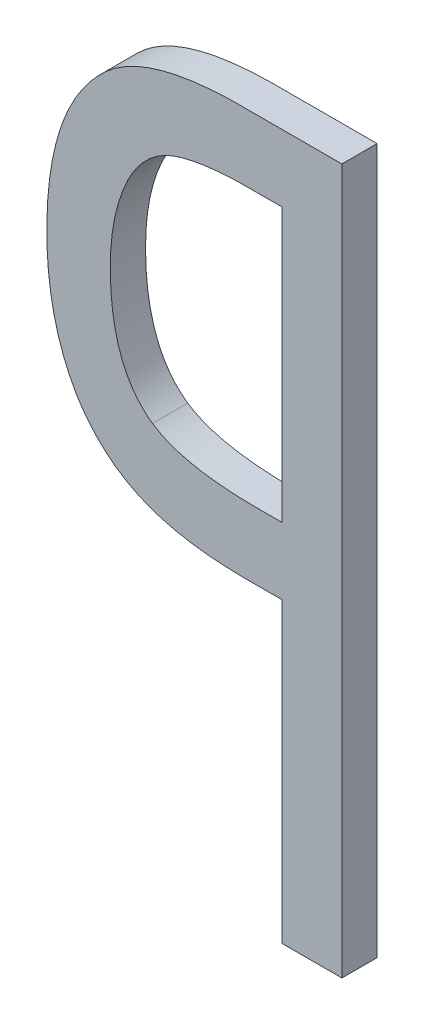
ISO-10303-21;
HEADER;
FILE_DESCRIPTION(('STEP AP214'),'2;1');
FILE_NAME('part.step','',(''),(''),'','','');
FILE_SCHEMA(('AUTOMOTIVE_DESIGN { 1 0 10303 214 1 1 1 1 }'));
ENDSEC;
DATA;
#1=APPLICATION_CONTEXT('core data for automotive mechanical design processes');
#2=APPLICATION_PROTOCOL_DEFINITION('international standard','automotive_design',2000,#1);
#3=PRODUCT_CONTEXT('',#1,'mechanical');
#4=PRODUCT('Part','Part','',(#3));
#5=PRODUCT_RELATED_PRODUCT_CATEGORY('part','',(#4));
#6=PRODUCT_DEFINITION_FORMATION('','',#4);
#7=PRODUCT_DEFINITION_CONTEXT('part definition',#1,'design');
#8=PRODUCT_DEFINITION('design','',#6,#7);
#9=PRODUCT_DEFINITION_SHAPE('','',#8);
#10=(LENGTH_UNIT() NAMED_UNIT(*) SI_UNIT(.MILLI.,.METRE.));
#11=(NAMED_UNIT(*) PLANE_ANGLE_UNIT() SI_UNIT($,.RADIAN.));
#12=(NAMED_UNIT(*) SI_UNIT($,.STERADIAN.) SOLID_ANGLE_UNIT());
#13=UNCERTAINTY_MEASURE_WITH_UNIT(LENGTH_MEASURE(1.E-05),#10,'distance_accuracy_value','');
#14=(GEOMETRIC_REPRESENTATION_CONTEXT(3) GLOBAL_UNCERTAINTY_ASSIGNED_CONTEXT((#13)) GLOBAL_UNIT_ASSIGNED_CONTEXT((#10,
#11,#12)) REPRESENTATION_CONTEXT('',''));
#15=CARTESIAN_POINT('',(0.,0.,0.));
#16=DIRECTION('',(0.,0.,1.));
#17=DIRECTION('',(1.,0.,0.));
#18=AXIS2_PLACEMENT_3D('',#15,#16,#17);
#19=CARTESIAN_POINT('',(181.550796816524,131.046786097001,-39.0997200126349));
#20=DIRECTION('',(0.,0.,-1.));
#21=DIRECTION('',(-1.,0.,0.));
#22=AXIS2_PLACEMENT_3D('',#19,#20,#21);
#23=PLANE('',#22);
#24=CARTESIAN_POINT('',(181.763595473262,130.346000730248,-39.0997200126349));
#25=CARTESIAN_POINT('',(181.756732321437,130.350761463896,-39.0997200126349));
#26=CARTESIAN_POINT('',(181.750157166845,130.355934036707,-39.0997200126349));
#27=CARTESIAN_POINT('',(181.737642316596,130.366998301502,-39.0997200126349));
#28=CARTESIAN_POINT('',(181.731702581685,130.372889949016,-39.0997200126349));
#29=CARTESIAN_POINT('',(181.723317033609,130.382184911456,-39.0997200126349));
#30=CARTESIAN_POINT('',(181.720610730206,130.385357343146,-39.0997200126349));
#31=CARTESIAN_POINT('',(181.715370490683,130.391841243842,-39.0997200126349));
#32=CARTESIAN_POINT('',(181.712836549915,130.395152709096,-39.0997200126349));
#33=CARTESIAN_POINT('',(181.705487839755,130.405282453905,-39.0997200126349));
#34=CARTESIAN_POINT('',(181.700931082425,130.412290602586,-39.0997200126349));
#35=CARTESIAN_POINT('',(181.694599592015,130.423084824539,-39.0997200126349));
#36=CARTESIAN_POINT('',(181.692573895048,130.426728066656,-39.0997200126349));
#37=CARTESIAN_POINT('',(181.68673352769,130.437790261836,-39.0997200126349));
#38=CARTESIAN_POINT('',(181.683158365458,130.445337361865,-39.0997200126349));
#39=CARTESIAN_POINT('',(181.676597405546,130.460678298835,-39.0997200126349));
#40=CARTESIAN_POINT('',(181.673611492064,130.468472086947,-39.0997200126349));
#41=CARTESIAN_POINT('',(181.669530605143,130.48029487976,-39.0997200126349));
#42=CARTESIAN_POINT('',(181.668236934623,130.484256745482,-39.0997200126349));
#43=CARTESIAN_POINT('',(181.664542100935,130.496203409522,-39.0997200126349));
#44=CARTESIAN_POINT('',(181.662328052703,130.504246804441,-39.0997200126349));
#45=CARTESIAN_POINT('',(181.658344803613,130.520439998701,-39.0997200126349));
#46=CARTESIAN_POINT('',(181.656575556095,130.528589786787,-39.0997200126349));
#47=CARTESIAN_POINT('',(181.653431310305,130.544964064335,-39.0997200126349));
#48=CARTESIAN_POINT('',(181.652056280976,130.553188547859,-39.0997200126349));
#49=CARTESIAN_POINT('',(181.65025657891,130.565561355583,-39.0997200126349));
#50=CARTESIAN_POINT('',(181.649700530435,130.569691196839,-39.0997200126349));
#51=CARTESIAN_POINT('',(181.648671001572,130.577961199805,-39.0997200126349));
#52=CARTESIAN_POINT('',(181.648197520671,130.582101361451,-39.0997200126349));
#53=CARTESIAN_POINT('',(181.647328475898,130.590389774817,-39.0997200126349));
#54=CARTESIAN_POINT('',(181.646932911606,130.594538026492,-39.0997200126349));
#55=CARTESIAN_POINT('',(181.646215409359,130.602840856955,-39.0997200126349));
#56=CARTESIAN_POINT('',(181.64589347106,130.606995435712,-39.0997200126349));
#57=CARTESIAN_POINT('',(181.645319104681,130.615309344297,-39.0997200126349));
#58=CARTESIAN_POINT('',(181.645066676318,130.619468674104,-39.0997200126349));
#59=CARTESIAN_POINT('',(181.644627976542,130.62779082943,-39.0997200126349));
#60=CARTESIAN_POINT('',(181.644441704893,130.631953654936,-39.0997200126349));
#61=CARTESIAN_POINT('',(181.643974785929,130.644445902201,-39.0997200126349));
#62=CARTESIAN_POINT('',(181.643786076035,130.652778475065,-39.0997200126349));
#63=CARTESIAN_POINT('',(181.643575057698,130.677790879122,-39.0997200126349));
#64=CARTESIAN_POINT('',(181.643908311022,130.694478502726,-39.0997200126349));
#65=CARTESIAN_POINT('',(181.64537202743,130.719446849241,-39.0997200126349));
#66=CARTESIAN_POINT('',(181.646020382373,130.727757724939,-39.0997200126349));
#67=CARTESIAN_POINT('',(181.648461364295,130.752659097983,-39.0997200126349));
#68=CARTESIAN_POINT('',(181.650749697957,130.76920687771,-39.0997200126349));
#69=CARTESIAN_POINT('',(181.655293233853,130.793811824895,-39.0997200126349));
#70=CARTESIAN_POINT('',(181.656992236452,130.801974916446,-39.0997200126349));
#71=CARTESIAN_POINT('',(181.660777125533,130.818212080014,-39.0997200126349));
#72=CARTESIAN_POINT('',(181.662863023257,130.826286149436,-39.0997200126349));
#73=CARTESIAN_POINT('',(181.667434366872,130.842321008277,-39.0997200126349));
#74=CARTESIAN_POINT('',(181.669919824022,130.850281794496,-39.0997200126349));
#75=CARTESIAN_POINT('',(181.675306655517,130.866061360848,-39.0997200126349));
#76=CARTESIAN_POINT('',(181.678208040555,130.873880137325,-39.0997200126349));
#77=CARTESIAN_POINT('',(181.684409662843,130.889359725093,-39.0997200126349));
#78=CARTESIAN_POINT('',(181.687709920827,130.897020528149,-39.0997200126349));
#79=CARTESIAN_POINT('',(181.694845906331,130.912095961287,-39.0997200126349));
#80=CARTESIAN_POINT('',(181.698681789615,130.91951051898,-39.0997200126349));
#81=CARTESIAN_POINT('',(181.706939139349,130.934006144769,-39.0997200126349));
#82=CARTESIAN_POINT('',(181.711360721407,130.941087146651,-39.0997200126349));
#83=CARTESIAN_POINT('',(181.723898489091,130.959257607972,-39.0997200126349));
#84=CARTESIAN_POINT('',(181.732558905756,130.969988436165,-39.0997200126349));
#85=CARTESIAN_POINT('',(181.746841607104,130.984797462629,-39.0997200126349));
#86=CARTESIAN_POINT('',(181.751811759159,130.989514842912,-39.0997200126349));
#87=CARTESIAN_POINT('',(181.762167199948,130.99847085375,-39.0997200126349));
#88=CARTESIAN_POINT('',(181.767552528698,131.002709438061,-39.0997200126349));
#89=CARTESIAN_POINT('',(181.782847956223,131.013597611445,-39.0997200126349));
#90=CARTESIAN_POINT('',(181.793154287587,131.019706831763,-39.0997200126349));
#91=CARTESIAN_POINT('',(181.809226660598,131.027517258586,-39.0997200126349));
#92=CARTESIAN_POINT('',(181.814678588176,131.029892896762,-39.0997200126349));
#93=CARTESIAN_POINT('',(181.828840352643,131.035408138516,-39.0997200126349));
#94=CARTESIAN_POINT('',(181.837672518171,131.038235648707,-39.0997200126349));
#95=CARTESIAN_POINT('',(181.846644357519,131.040548109814,-39.0997200126349));
#96=B_SPLINE_CURVE_WITH_KNOTS('',3,(#24,#25,#26,#27,#28,#29,#30,#31,#32,#33,#34,#35,#36,#37,#38,
#39,#40,#41,#42,#43,#44,#45,#46,#47,#48,#49,#50,#51,#52,#53,#54,#55,#56,#57,#58,#59,#60,#61,#62,
#63,#64,#65,#66,#67,#68,#69,#70,#71,#72,#73,#74,#75,#76,#77,#78,#79,#80,#81,#82,#83,#84,#85,#86,
#87,#88,#89,#90,#91,#92,#93,#94,#95),.UNSPECIFIED.,.F.,.F.,(4,2,2,2,2,2,2,2,2,2,2,2,2,2,2,2,2,2,
2,2,2,2,2,2,2,2,2,2,2,2,2,2,2,2,2,4),(0.,0.0250422552227296,0.0500829625639329,
0.0625876050149948,0.0750919101435876,0.100122469200076,0.11262564985577,0.137647383331523,
0.162664194553288,0.175165875044121,0.200177147930221,0.225185795983085,0.250192473327275,
0.262693149782032,0.275193748635132,0.287694280164148,0.300194753184744,0.312695175257167,
0.325195552868069,0.350198170195568,0.400224107405032,0.425228671493057,0.475272113476686,
0.50027870685757,0.525286026951959,0.550294051886167,0.575302719772092,0.600312688160363,
0.625329944841326,0.650352146958575,0.691504940045529,0.712036801961213,0.732570645311394,
0.76831792928133,0.786144095132884,0.813904951508696),.UNSPECIFIED.);
#97=CARTESIAN_POINT('',(181.763595473262,130.346000730248,-39.0997200126349));
#98=VERTEX_POINT('',#97);
#99=CARTESIAN_POINT('',(181.846644357519,131.040548109814,-39.0997200126349));
#100=VERTEX_POINT('',#99);
#101=EDGE_CURVE('E227',#98,#100,#96,.T.);
#102=ORIENTED_EDGE('',*,*,#101,.F.);
#103=CARTESIAN_POINT('',(182.131106190041,130.286710100285,-39.0997200126349));
#104=CARTESIAN_POINT('',(182.122856874198,130.286702133238,-39.0997200126349));
#105=CARTESIAN_POINT('',(182.114607592428,130.286706116518,-39.0997200126349));
#106=CARTESIAN_POINT('',(182.098108019772,130.286714084539,-39.0997200126349));
#107=CARTESIAN_POINT('',(182.089857728886,130.286718069282,-39.0997200126349));
#108=CARTESIAN_POINT('',(182.073342437774,130.286702117146,-39.0997200126349));
#109=CARTESIAN_POINT('',(182.065077437428,130.286682137805,-39.0997200126349));
#110=CARTESIAN_POINT('',(182.048548095393,130.286753827207,-39.0997200126349));
#111=CARTESIAN_POINT('',(182.040283753691,130.28684549078,-39.0997200126349));
#112=CARTESIAN_POINT('',(182.015155430803,130.287368344109,-39.0997200126349));
#113=CARTESIAN_POINT('',(181.99829553195,130.288053653407,-39.0997200126349));
#114=CARTESIAN_POINT('',(181.964638372224,130.290235124392,-39.0997200126349));
#115=CARTESIAN_POINT('',(181.947841072767,130.291730653546,-39.0997200126349));
#116=CARTESIAN_POINT('',(181.916736842526,130.295509393823,-39.0997200126349));
#117=CARTESIAN_POINT('',(181.902413513226,130.297651381386,-39.0997200126349));
#118=CARTESIAN_POINT('',(181.87404973607,130.302954084997,-39.0997200126349));
#119=CARTESIAN_POINT('',(181.860008046675,130.306108001416,-39.0997200126349));
#120=CARTESIAN_POINT('',(181.831709459105,130.313961675201,-39.0997200126349));
#121=CARTESIAN_POINT('',(181.817467570649,130.318719824106,-39.0997200126349));
#122=CARTESIAN_POINT('',(181.796689432484,130.327491449959,-39.0997200126349));
#123=CARTESIAN_POINT('',(181.789823078542,130.330711046203,-39.0997200126349));
#124=CARTESIAN_POINT('',(181.776421605159,130.337822470271,-39.0997200126349));
#125=CARTESIAN_POINT('',(181.769887662087,130.34171649612,-39.0997200126349));
#126=CARTESIAN_POINT('',(181.763595473262,130.346000730248,-39.0997200126349));
#127=B_SPLINE_CURVE_WITH_KNOTS('',3,(#103,#104,#105,#106,#107,#108,#109,#110,#111,#112,#113,
#114,#115,#116,#117,#118,#119,#120,#121,#122,#123,#124,#125,#126),.UNSPECIFIED.,.F.,.F.,(4,2,2,
2,2,2,2,2,2,2,2,4),(0.,0.024747879382031,0.0494987861235918,0.0742936162696472,
0.0990872980903224,0.149692346167525,0.200257944024168,0.243675914726005,0.286808043636492,
0.331719110707027,0.354437425497692,0.377231224609557),.UNSPECIFIED.);
#128=CARTESIAN_POINT('',(182.131106190041,130.286710100285,-39.0997200126349));
#129=VERTEX_POINT('',#128);
#130=EDGE_CURVE('E220',#129,#98,#127,.T.);
#131=ORIENTED_EDGE('',*,*,#130,.F.);
#132=DIRECTION('',(0.,1.,0.));
#133=VECTOR('',#132,1.);
#134=CARTESIAN_POINT('',(182.131106190041,131.0617233348,-39.0997200126349));
#135=LINE('',#134,#133);
#136=CARTESIAN_POINT('',(182.131106190041,131.0617233348,-39.0997200126349));
#137=VERTEX_POINT('',#136);
#138=EDGE_CURVE('E124',#137,#129,#135,.F.);
#139=ORIENTED_EDGE('',*,*,#138,.F.);
#140=CARTESIAN_POINT('',(181.846644357519,131.040548109814,-39.0997200126349));
#141=CARTESIAN_POINT('',(181.86191466799,131.044748444071,-39.0997200126349));
#142=CARTESIAN_POINT('',(181.877373818254,131.048139055949,-39.0997200126349));
#143=CARTESIAN_POINT('',(181.908454209381,131.053603416579,-39.0997200126349));
#144=CARTESIAN_POINT('',(181.924074371816,131.055683175191,-39.0997200126349));
#145=CARTESIAN_POINT('',(181.955579274959,131.058879067768,-39.0997200126349));
#146=CARTESIAN_POINT('',(181.971465025367,131.059984218005,-39.0997200126349));
#147=CARTESIAN_POINT('',(181.995332798463,131.061058677456,-39.0997200126349));
#148=CARTESIAN_POINT('',(182.003302882144,131.061319589195,-39.0997200126349));
#149=CARTESIAN_POINT('',(182.019247611734,131.061640853773,-39.0997200126349));
#150=CARTESIAN_POINT('',(182.027222257992,131.061701188339,-39.0997200126349));
#151=CARTESIAN_POINT('',(182.043201048223,131.061745564196,-39.0997200126349));
#152=CARTESIAN_POINT('',(182.051205190825,131.061729318936,-39.0997200126349));
#153=CARTESIAN_POINT('',(182.067213191892,131.061717350951,-39.0997200126349));
#154=CARTESIAN_POINT('',(182.075217050352,131.061721627246,-39.0997200126349));
#155=CARTESIAN_POINT('',(182.091201596705,131.061725037417,-39.0997200126349));
#156=CARTESIAN_POINT('',(182.099182284668,131.061724186129,-39.0997200126349));
#157=CARTESIAN_POINT('',(182.115144041029,131.061722483431,-39.0997200126349));
#158=CARTESIAN_POINT('',(182.123125109428,131.061721632021,-39.0997200126349));
#159=CARTESIAN_POINT('',(182.131106190041,131.0617233348,-39.0997200126349));
#160=B_SPLINE_CURVE_WITH_KNOTS('',3,(#140,#141,#142,#143,#144,#145,#146,#147,#148,#149,#150,
#151,#152,#153,#154,#155,#156,#157,#158,#159),.UNSPECIFIED.,.F.,.F.,(4,2,2,2,2,2,2,2,2,4),(0.,
0.047443741938871,0.094668355701303,0.14241862390376,0.166339517996747,0.190262591202426,
0.214275252065447,0.238286766097948,0.262228842200072,0.286172059610438),.UNSPECIFIED.);
#161=EDGE_CURVE('E207',#100,#137,#160,.T.);
#162=ORIENTED_EDGE('',*,*,#161,.F.);
#163=EDGE_LOOP('',(#102,#131,#139,#162));
#164=FACE_BOUND('',#163,.T.);
#165=CARTESIAN_POINT('',(182.300696668639,131.252300359681,-39.0997200126349));
#166=CARTESIAN_POINT('',(182.28410055348,131.252300436732,-39.0997200126349));
#167=CARTESIAN_POINT('',(182.267504439264,131.252300398207,-39.0997200126349));
#168=CARTESIAN_POINT('',(182.234312048696,131.252300321156,-39.0997200126349));
#169=CARTESIAN_POINT('',(182.217715772345,131.252300282629,-39.0997200126349));
#170=CARTESIAN_POINT('',(182.184382274465,131.252300437388,-39.0997200126349));
#171=CARTESIAN_POINT('',(182.16764505292,131.252300632644,-39.0997200126349));
#172=CARTESIAN_POINT('',(182.134170781899,131.252300086722,-39.0997200126349));
#173=CARTESIAN_POINT('',(182.117433732423,131.252299345552,-39.0997200126349));
#174=CARTESIAN_POINT('',(182.088572387924,131.252301094314,-39.0997200126349));
#175=CARTESIAN_POINT('',(182.076448099701,131.252302750041,-39.0997200126349));
#176=CARTESIAN_POINT('',(182.052198683068,131.252297969143,-39.0997200126349));
#177=CARTESIAN_POINT('',(182.040073554663,131.252291531914,-39.0997200126349));
#178=CARTESIAN_POINT('',(182.021883113553,131.25230477543,-39.0997200126349));
#179=CARTESIAN_POINT('',(182.015817894148,131.252313010655,-39.0997200126349));
#180=CARTESIAN_POINT('',(182.003688071752,131.252243677018,-39.0997200126349));
#181=CARTESIAN_POINT('',(181.997623468744,131.252166111684,-39.0997200126349));
#182=CARTESIAN_POINT('',(181.979433868164,131.251799563285,-39.0997200126349));
#183=CARTESIAN_POINT('',(181.967311251075,131.251376744792,-39.0997200126349));
#184=CARTESIAN_POINT('',(181.94312931242,131.250129085639,-39.0997200126349));
#185=CARTESIAN_POINT('',(181.931069919337,131.249305684679,-39.0997200126349));
#186=CARTESIAN_POINT('',(181.90698968781,131.247202499862,-39.0997200126349));
#187=CARTESIAN_POINT('',(181.894968855259,131.245922649313,-39.0997200126349));
#188=CARTESIAN_POINT('',(181.859029559529,131.241309361352,-39.0997200126349));
#189=CARTESIAN_POINT('',(181.835202032024,131.237200848424,-39.0997200126349));
#190=CARTESIAN_POINT('',(181.789168982239,131.226492170435,-39.0997200126349));
#191=CARTESIAN_POINT('',(181.766938105764,131.220008886231,-39.0997200126349));
#192=CARTESIAN_POINT('',(181.734536347617,131.207870392803,-39.0997200126349));
#193=CARTESIAN_POINT('',(181.723909719441,131.203431143714,-39.0997200126349));
#194=CARTESIAN_POINT('',(181.703082996192,131.193652315794,-39.0997200126349));
#195=CARTESIAN_POINT('',(181.692882613797,131.188313356068,-39.0997200126349));
#196=CARTESIAN_POINT('',(181.672916871645,131.176562394014,-39.0997200126349));
#197=CARTESIAN_POINT('',(181.66315966035,131.170136340203,-39.0997200126349));
#198=CARTESIAN_POINT('',(181.649111602901,131.15970459437,-39.0997200126349));
#199=CARTESIAN_POINT('',(181.644525247724,131.156093713517,-39.0997200126349));
#200=CARTESIAN_POINT('',(181.635582468009,131.148596820456,-39.0997200126349));
#201=CARTESIAN_POINT('',(181.631226105228,131.144710735,-39.0997200126349));
#202=CARTESIAN_POINT('',(181.618373254588,131.132767743589,-39.0997200126349));
#203=CARTESIAN_POINT('',(181.610120185276,131.124447525944,-39.0997200126349));
#204=CARTESIAN_POINT('',(181.594333778107,131.107148708189,-39.0997200126349));
#205=CARTESIAN_POINT('',(181.586800574705,131.098169985638,-39.0997200126349));
#206=CARTESIAN_POINT('',(181.571409081786,131.078247713436,-39.0997200126349));
#207=CARTESIAN_POINT('',(181.563670890306,131.067211222041,-39.0997200126349));
#208=CARTESIAN_POINT('',(181.549196822938,131.044506542614,-39.0997200126349));
#209=CARTESIAN_POINT('',(181.542460813594,131.032838438973,-39.0997200126349));
#210=CARTESIAN_POINT('',(181.523742225122,130.997108820951,-39.0997200126349));
#211=CARTESIAN_POINT('',(181.51321593555,130.972277942333,-39.0997200126349));
#212=CARTESIAN_POINT('',(181.490935747265,130.90795850956,-39.0997200126349));
#213=CARTESIAN_POINT('',(181.481499691122,130.867690070194,-39.0997200126349));
#214=CARTESIAN_POINT('',(181.468651184549,130.786048170509,-39.0997200126349));
#215=CARTESIAN_POINT('',(181.465281176346,130.744668964534,-39.0997200126349));
#216=CARTESIAN_POINT('',(181.463422296782,130.680479923193,-39.0997200126349));
#217=CARTESIAN_POINT('',(181.463418942833,130.657697181468,-39.0997200126349));
#218=CARTESIAN_POINT('',(181.464902718549,130.61218272222,-39.0997200126349));
#219=CARTESIAN_POINT('',(181.466389936278,130.58945100779,-39.0997200126349));
#220=CARTESIAN_POINT('',(181.47348377037,130.521891230125,-39.0997200126349));
#221=CARTESIAN_POINT('',(181.48169938695,130.477246131732,-39.0997200126349));
#222=CARTESIAN_POINT('',(181.500774170722,130.412852729217,-39.0997200126349));
#223=CARTESIAN_POINT('',(181.508127469791,130.392058255274,-39.0997200126349));
#224=CARTESIAN_POINT('',(181.525293103133,130.351310851629,-39.0997200126349));
#225=CARTESIAN_POINT('',(181.535125620312,130.33136648155,-39.0997200126349));
#226=CARTESIAN_POINT('',(181.546271290162,130.312120370269,-39.0997200126349));
#227=B_SPLINE_CURVE_WITH_KNOTS('',3,(#165,#166,#167,#168,#169,#170,#171,#172,#173,#174,#175,
#176,#177,#178,#179,#180,#181,#182,#183,#184,#185,#186,#187,#188,#189,#190,#191,#192,#193,#194,
#195,#196,#197,#198,#199,#200,#201,#202,#203,#204,#205,#206,#207,#208,#209,#210,#211,#212,#213,
#214,#215,#216,#217,#218,#219,#220,#221,#222,#223,#224,#225,#226),.UNSPECIFIED.,.F.,.F.,(4,2,2,
2,2,2,2,2,2,2,2,2,2,2,2,2,2,2,2,2,2,2,2,2,2,2,2,2,2,2,4),(0.,0.0497883435917335,
0.0995771735874673,0.149788833447795,0.200000000000033,0.23637282417896,0.272748366817843,
0.290943823634581,0.309138532684599,0.345522468793317,0.381776595856928,0.418036022190148,
0.490458280185744,0.559711883377948,0.594226517071238,0.628717497021744,0.663694165020671,
0.681195791497957,0.698702093768278,0.733818178025985,0.768940808382633,0.80932027132452,
0.849694352285523,0.930279258973146,1.05366851417596,1.17791777811745,1.24622812757137,
1.31454251309695,1.44982278117726,1.51585551321244,1.58244421683673),.UNSPECIFIED.);
#228=CARTESIAN_POINT('',(182.300696668639,131.252300359681,-39.0997200126349));
#229=VERTEX_POINT('',#228);
#230=CARTESIAN_POINT('',(181.546271290162,130.312120370269,-39.0997200126349));
#231=VERTEX_POINT('',#230);
#232=EDGE_CURVE('E88',#229,#231,#227,.T.);
#233=ORIENTED_EDGE('',*,*,#232,.F.);
#234=DIRECTION('',(0.,1.,0.));
#235=VECTOR('',#234,1.);
#236=CARTESIAN_POINT('',(182.300696668639,129.252300359681,-39.0997200126349));
#237=LINE('',#236,#235);
#238=CARTESIAN_POINT('',(182.300696668639,129.252300359681,-39.0997200126349));
#239=VERTEX_POINT('',#238);
#240=EDGE_CURVE('E127',#239,#229,#237,.T.);
#241=ORIENTED_EDGE('',*,*,#240,.F.);
#242=DIRECTION('',(1.,0.,0.));
#243=VECTOR('',#242,1.);
#244=CARTESIAN_POINT('',(182.131106190041,129.252300359681,-39.0997200126349));
#245=LINE('',#244,#243);
#246=CARTESIAN_POINT('',(182.131106190041,129.252300359681,-39.0997200126349));
#247=VERTEX_POINT('',#246);
#248=EDGE_CURVE('E106',#247,#239,#245,.T.);
#249=ORIENTED_EDGE('',*,*,#248,.F.);
#250=DIRECTION('',(0.,1.,0.));
#251=VECTOR('',#250,1.);
#252=CARTESIAN_POINT('',(182.131106190041,130.096662456029,-39.0997200126349));
#253=LINE('',#252,#251);
#254=CARTESIAN_POINT('',(182.131106190041,130.096662456029,-39.0997200126349));
#255=VERTEX_POINT('',#254);
#256=EDGE_CURVE('E101',#255,#247,#253,.F.);
#257=ORIENTED_EDGE('',*,*,#256,.F.);
#258=CARTESIAN_POINT('',(181.546271290162,130.312120370269,-39.0997200126349));
#259=CARTESIAN_POINT('',(181.552404866346,130.301794395073,-39.0997200126349));
#260=CARTESIAN_POINT('',(181.558932598672,130.291703476702,-39.0997200126349));
#261=CARTESIAN_POINT('',(181.572803087649,130.272085232736,-39.0997200126349));
#262=CARTESIAN_POINT('',(181.580146609957,130.262558449683,-39.0997200126349));
#263=CARTESIAN_POINT('',(181.603309856355,130.235126992069,-39.0997200126349));
#264=CARTESIAN_POINT('',(181.62035086781,130.21821825068,-39.0997200126349));
#265=CARTESIAN_POINT('',(181.656862498693,130.188235586718,-39.0997200126349));
#266=CARTESIAN_POINT('',(181.676269219928,130.175083360153,-39.0997200126349));
#267=CARTESIAN_POINT('',(181.717048492987,130.152369083333,-39.0997200126349));
#268=CARTESIAN_POINT('',(181.738419623121,130.142804461723,-39.0997200126349));
#269=CARTESIAN_POINT('',(181.776916544566,130.129024513601,-39.0997200126349));
#270=CARTESIAN_POINT('',(181.793790550245,130.124071783662,-39.0997200126349));
#271=CARTESIAN_POINT('',(181.82791033063,130.115621134678,-39.0997200126349));
#272=CARTESIAN_POINT('',(181.84515653281,130.112124993573,-39.0997200126349));
#273=CARTESIAN_POINT('',(181.879977914566,130.106304359145,-39.0997200126349));
#274=CARTESIAN_POINT('',(181.897554610022,130.103989199362,-39.0997200126349));
#275=CARTESIAN_POINT('',(181.932794228483,130.100361040092,-39.0997200126349));
#276=CARTESIAN_POINT('',(181.950457076572,130.099047287109,-39.0997200126349));
#277=CARTESIAN_POINT('',(181.981813420587,130.097461308108,-39.0997200126349));
#278=CARTESIAN_POINT('',(181.995498952413,130.097020477606,-39.0997200126349));
#279=CARTESIAN_POINT('',(182.01603422648,130.096697699396,-39.0997200126349));
#280=CARTESIAN_POINT('',(182.02288168377,130.096646538674,-39.0997200126349));
#281=CARTESIAN_POINT('',(182.036576842884,130.096641400762,-39.0997200126349));
#282=CARTESIAN_POINT('',(182.043424544701,130.096687429038,-39.0997200126349));
#283=CARTESIAN_POINT('',(182.063748751418,130.096766823219,-39.0997200126349));
#284=CARTESIAN_POINT('',(182.077225349781,130.096744800401,-39.0997200126349));
#285=CARTESIAN_POINT('',(182.104170074383,130.096683552499,-39.0997200126349));
#286=CARTESIAN_POINT('',(182.117638200629,130.096644338223,-39.0997200126349));
#287=CARTESIAN_POINT('',(182.131106190041,130.096662456029,-39.0997200126349));
#288=B_SPLINE_CURVE_WITH_KNOTS('',3,(#258,#259,#260,#261,#262,#263,#264,#265,#266,#267,#268,
#269,#270,#271,#272,#273,#274,#275,#276,#277,#278,#279,#280,#281,#282,#283,#284,#285,#286,#287),
.UNSPECIFIED.,.F.,.F.,(4,2,2,2,2,2,2,2,2,2,2,2,2,2,4),(0.,0.0360170490418908,0.0720681920025442,
0.143647167475988,0.213602081709017,0.28350676067692,0.336183229448099,0.388923809116493,
0.44207499030828,0.49518613904552,0.536256051185133,0.556798224049608,0.577341552309725,
0.617771215859034,0.658175496394001),.UNSPECIFIED.);
#289=EDGE_CURVE('E24',#231,#255,#288,.T.);
#290=ORIENTED_EDGE('',*,*,#289,.F.);
#291=EDGE_LOOP('',(#233,#241,#249,#257,#290));
#292=FACE_BOUND('',#291,.T.);
#293=ADVANCED_FACE('F17',(#164,#292),#23,.T.);
#294=CARTESIAN_POINT('',(182.131106190041,130.096662456029,-39.0997200126349));
#295=DIRECTION('',(-1.,0.,0.));
#296=DIRECTION('',(0.,0.,1.));
#297=AXIS2_PLACEMENT_3D('',#294,#295,#296);
#298=PLANE('',#297);
#299=ORIENTED_EDGE('',*,*,#256,.T.);
#300=DIRECTION('',(0.,0.,-1.));
#301=VECTOR('',#300,1.);
#302=CARTESIAN_POINT('',(182.131106190041,129.252300359681,-39.0997200126349));
#303=LINE('',#302,#301);
#304=CARTESIAN_POINT('',(182.131106190041,129.252300359681,-38.9997200126349));
#305=VERTEX_POINT('',#304);
#306=EDGE_CURVE('E119',#305,#247,#303,.T.);
#307=ORIENTED_EDGE('',*,*,#306,.F.);
#308=DIRECTION('',(0.,1.,0.));
#309=VECTOR('',#308,1.);
#310=CARTESIAN_POINT('',(182.131106190041,131.046786097001,-38.9997200126349));
#311=LINE('',#310,#309);
#312=CARTESIAN_POINT('',(182.131106190041,130.096662456029,-38.9997200126349));
#313=VERTEX_POINT('',#312);
#314=EDGE_CURVE('E114',#305,#313,#311,.T.);
#315=ORIENTED_EDGE('',*,*,#314,.T.);
#316=DIRECTION('',(0.,0.,1.));
#317=VECTOR('',#316,1.);
#318=CARTESIAN_POINT('',(182.131106190041,130.096662456029,-39.0497200126349));
#319=LINE('',#318,#317);
#320=EDGE_CURVE('E97',#255,#313,#319,.T.);
#321=ORIENTED_EDGE('',*,*,#320,.F.);
#322=EDGE_LOOP('',(#299,#307,#315,#321));
#323=FACE_BOUND('',#322,.T.);
#324=ADVANCED_FACE('F112',(#323),#298,.T.);
#325=CARTESIAN_POINT('',(181.546271290162,130.312120370269,-39.0997200126349));
#326=CARTESIAN_POINT('',(181.546271290162,130.312120370269,-38.9997200126349));
#327=CARTESIAN_POINT('',(181.600990414836,130.220008141576,-39.0997200126349));
#328=CARTESIAN_POINT('',(181.600990414836,130.220008141576,-38.9997200126349));
#329=CARTESIAN_POINT('',(181.679770431209,130.158599989115,-39.0997200126349));
#330=CARTESIAN_POINT('',(181.679770431209,130.158599989115,-38.9997200126349));
#331=CARTESIAN_POINT('',(181.85099428998,130.106987709221,-39.0997200126349));
#332=CARTESIAN_POINT('',(181.85099428998,130.106987709221,-38.9997200126349));
#333=CARTESIAN_POINT('',(181.935514425251,130.096133075404,-39.0997200126349));
#334=CARTESIAN_POINT('',(181.935514425251,130.096133075404,-38.9997200126349));
#335=CARTESIAN_POINT('',(182.068236979181,130.096826744323,-39.0997200126349));
#336=CARTESIAN_POINT('',(182.068236979181,130.096826744323,-38.9997200126349));
#337=CARTESIAN_POINT('',(182.099671799271,130.096662456029,-39.0997200126349));
#338=CARTESIAN_POINT('',(182.099671799271,130.096662456029,-38.9997200126349));
#339=CARTESIAN_POINT('',(182.131106190041,130.096662456029,-39.0997200126349));
#340=CARTESIAN_POINT('',(182.131106190041,130.096662456029,-38.9997200126349));
#341=B_SPLINE_SURFACE_WITH_KNOTS('',3,1,((#325,#326),(#327,#328),(#329,#330),(#331,#332),(#333,
#334),(#335,#336),(#337,#338),(#339,#340)),.UNSPECIFIED.,.F.,.F.,.F.,(4,2,2,4),(2,2),(0.,
0.539096646209267,0.890839817151664,1.),(1.,1.09999999999999),.UNSPECIFIED.);
#342=CARTESIAN_POINT('',(182.131106190041,130.096662456029,-38.9997200126349));
#343=CARTESIAN_POINT('',(182.122772463398,130.0966655657,-38.9997200126349));
#344=CARTESIAN_POINT('',(182.11443877644,130.09667555782,-38.9997200126349));
#345=CARTESIAN_POINT('',(182.097772134176,130.096700267658,-38.9997200126349));
#346=CARTESIAN_POINT('',(182.08943917887,130.096714984965,-38.9997200126349));
#347=CARTESIAN_POINT('',(182.072764266055,130.096740123034,-38.9997200126349));
#348=CARTESIAN_POINT('',(182.064422308474,130.096750539173,-38.9997200126349));
#349=CARTESIAN_POINT('',(182.04773839991,130.09670191354,-38.9997200126349));
#350=CARTESIAN_POINT('',(182.039396448931,130.096642870161,-38.9997200126349));
#351=CARTESIAN_POINT('',(182.022713428872,130.096646337177,-38.9997200126349));
#352=CARTESIAN_POINT('',(182.014372359865,130.096708827946,-38.9997200126349));
#353=CARTESIAN_POINT('',(181.997693804116,130.097009706441,-38.9997200126349));
#354=CARTESIAN_POINT('',(181.989356317239,130.097248086868,-38.9997200126349));
#355=CARTESIAN_POINT('',(181.964317406705,130.098231700578,-38.9997200126349));
#356=CARTESIAN_POINT('',(181.947625313394,130.099245530903,-38.9997200126349));
#357=CARTESIAN_POINT('',(181.914304224671,130.102118608621,-38.9997200126349));
#358=CARTESIAN_POINT('',(181.897675260677,130.103978232381,-38.9997200126349));
#359=CARTESIAN_POINT('',(181.864217797439,130.108759038594,-38.9997200126349));
#360=CARTESIAN_POINT('',(181.847392238074,130.111701287097,-38.9997200126349));
#361=CARTESIAN_POINT('',(181.814002580372,130.118836360548,-38.9997200126349));
#362=CARTESIAN_POINT('',(181.79743843225,130.123028944274,-38.9997200126349));
#363=CARTESIAN_POINT('',(181.7648966832,130.133053883181,-38.9997200126349));
#364=CARTESIAN_POINT('',(181.748916375656,130.138877169064,-38.9997200126349));
#365=CARTESIAN_POINT('',(181.717772144577,130.152384294702,-38.9997200126349));
#366=CARTESIAN_POINT('',(181.702607563693,130.160066608064,-38.9997200126349));
#367=CARTESIAN_POINT('',(181.66864776027,130.180114439449,-38.9997200126349));
#368=CARTESIAN_POINT('',(181.650264347588,130.193191034555,-38.9997200126349));
#369=CARTESIAN_POINT('',(181.616050968673,130.222394325764,-38.9997200126349));
#370=CARTESIAN_POINT('',(181.600225242326,130.238525992071,-38.9997200126349));
#371=CARTESIAN_POINT('',(181.578494152978,130.264676050758,-38.9997200126349));
#372=CARTESIAN_POINT('',(181.571518610297,130.273832305275,-38.9997200126349));
#373=CARTESIAN_POINT('',(181.558334658835,130.292629214169,-38.9997200126349));
#374=CARTESIAN_POINT('',(181.552123368987,130.302267843752,-38.9997200126349));
#375=CARTESIAN_POINT('',(181.546271290162,130.312120370269,-38.9997200126349));
#376=B_SPLINE_CURVE_WITH_KNOTS('',3,(#342,#343,#344,#345,#346,#347,#348,#349,#350,#351,#352,
#353,#354,#355,#356,#357,#358,#359,#360,#361,#362,#363,#364,#365,#366,#367,#368,#369,#370,#371,
#372,#373,#374,#375),.UNSPECIFIED.,.F.,.F.,(4,2,2,2,2,2,2,2,2,2,2,2,2,2,2,2,4),(0.,
0.0250011104450972,0.0500000443792705,0.0750257837476664,0.100052102211303,0.125074379402375,
0.150095618422101,0.200245355354218,0.250417430065827,0.301622391929785,0.352817481442413,
0.403733314302135,0.454607482649754,0.52193380408924,0.589370612545853,0.623871976545457,
0.658239010624243),.UNSPECIFIED.);
#377=CARTESIAN_POINT('',(181.546271290162,130.312120370269,-38.9997200126349));
#378=VERTEX_POINT('',#377);
#379=EDGE_CURVE('E177',#313,#378,#376,.T.);
#380=DIRECTION('',(0.,0.,1.));
#381=VECTOR('',#380,1.);
#382=CARTESIAN_POINT('',(181.546271290162,130.312120370269,-39.0497200126349));
#383=LINE('',#382,#381);
#384=EDGE_CURVE('E99',#231,#378,#383,.T.);
#385=ORIENTED_EDGE('',*,*,#289,.T.);
#386=ORIENTED_EDGE('',*,*,#320,.T.);
#387=ORIENTED_EDGE('',*,*,#379,.T.);
#388=ORIENTED_EDGE('',*,*,#384,.F.);
#389=EDGE_LOOP('',(#385,#386,#387,#388));
#390=FACE_BOUND('',#389,.T.);
#391=ADVANCED_FACE('F94',(#390),#341,.T.);
#392=CARTESIAN_POINT('',(182.300696668639,131.252300359681,-39.0997200126349));
#393=CARTESIAN_POINT('',(182.300696668639,131.252300359681,-38.9997200126349));
#394=CARTESIAN_POINT('',(182.206264136697,131.252300359681,-39.0997200126349));
#395=CARTESIAN_POINT('',(182.206264136697,131.252300359681,-38.9997200126349));
#396=CARTESIAN_POINT('',(182.111831604754,131.252300359681,-39.0997200126349));
#397=CARTESIAN_POINT('',(182.111831604754,131.252300359681,-38.9997200126349));
#398=CARTESIAN_POINT('',(181.840823174043,131.252300359681,-39.0997200126349));
#399=CARTESIAN_POINT('',(181.840823174043,131.252300359681,-38.9997200126349));
#400=CARTESIAN_POINT('',(181.712757137573,131.217361238453,-39.0997200126349));
#401=CARTESIAN_POINT('',(181.712757137573,131.217361238453,-38.9997200126349));
#402=CARTESIAN_POINT('',(181.520850464741,131.046245866155,-39.0997200126349));
#403=CARTESIAN_POINT('',(181.520850464741,131.046245866155,-38.9997200126349));
#404=CARTESIAN_POINT('',(181.463610484804,130.887557109284,-39.0997200126349));
#405=CARTESIAN_POINT('',(181.463610484804,130.887557109284,-38.9997200126349));
#406=CARTESIAN_POINT('',(181.463610484804,130.52651952326,-39.0997200126349));
#407=CARTESIAN_POINT('',(181.463610484804,130.52651952326,-38.9997200126349));
#408=CARTESIAN_POINT('',(181.49116408659,130.407408882709,-39.0997200126349));
#409=CARTESIAN_POINT('',(181.49116408659,130.407408882709,-38.9997200126349));
#410=CARTESIAN_POINT('',(181.546271290162,130.312120370269,-39.0997200126349));
#411=CARTESIAN_POINT('',(181.546271290162,130.312120370269,-38.9997200126349));
#412=B_SPLINE_SURFACE_WITH_KNOTS('',3,1,((#392,#393),(#394,#395),(#396,#397),(#398,#399),(#400,
#401),(#402,#403),(#404,#405),(#406,#407),(#408,#409),(#410,#411)),.UNSPECIFIED.,.F.,.F.,.F.,(4,
2,2,2,4),(2,2),(0.,0.138101771882247,0.396333167251114,0.761011664454259,1.),(1.,
1.09999999999999),.UNSPECIFIED.);
#413=CARTESIAN_POINT('',(181.546271290162,130.312120370269,-38.9997200126349));
#414=CARTESIAN_POINT('',(181.530794552116,130.33881920732,-38.9997200126349));
#415=CARTESIAN_POINT('',(181.517882071044,130.366825956458,-38.9997200126349));
#416=CARTESIAN_POINT('',(181.496665170186,130.424287584859,-38.9997200126349));
#417=CARTESIAN_POINT('',(181.488322627639,130.45372818098,-38.9997200126349));
#418=CARTESIAN_POINT('',(181.476733570145,130.507567214236,-38.9997200126349));
#419=CARTESIAN_POINT('',(181.472811118142,130.531831356548,-38.9997200126349));
#420=CARTESIAN_POINT('',(181.467078395954,130.580625653639,-38.9997200126349));
#421=CARTESIAN_POINT('',(181.46527001302,130.605156026402,-38.9997200126349));
#422=CARTESIAN_POINT('',(181.463410452348,130.654430527074,-38.9997200126349));
#423=CARTESIAN_POINT('',(181.463370690124,130.679175012815,-38.9997200126349));
#424=CARTESIAN_POINT('',(181.464829400323,130.728609277648,-38.9997200126349));
#425=CARTESIAN_POINT('',(181.46632702253,130.753299079419,-38.9997200126349));
#426=CARTESIAN_POINT('',(181.470505669551,130.794915964758,-38.9997200126349));
#427=CARTESIAN_POINT('',(181.472680268444,130.811892260648,-38.9997200126349));
#428=CARTESIAN_POINT('',(181.478077221377,130.8456725225,-38.9997200126349));
#429=CARTESIAN_POINT('',(181.481299493864,130.862476501771,-38.9997200126349));
#430=CARTESIAN_POINT('',(181.492719560818,130.912324164379,-38.9997200126349));
#431=CARTESIAN_POINT('',(181.502687533335,130.945006699051,-38.9997200126349));
#432=CARTESIAN_POINT('',(181.525359708644,131.00035945182,-38.9997200126349));
#433=CARTESIAN_POINT('',(181.536810240373,131.023532661492,-38.9997200126349));
#434=CARTESIAN_POINT('',(181.556726793816,131.05665094309,-38.9997200126349));
#435=CARTESIAN_POINT('',(181.563828885336,131.067424349998,-38.9997200126349));
#436=CARTESIAN_POINT('',(181.578951782839,131.088317028946,-38.9997200126349));
#437=CARTESIAN_POINT('',(181.586972956381,131.098436036731,-38.9997200126349));
#438=CARTESIAN_POINT('',(181.602123758565,131.115866639056,-38.9997200126349));
#439=CARTESIAN_POINT('',(181.609088065381,131.123322232362,-38.9997200126349));
#440=CARTESIAN_POINT('',(181.619924482101,131.134106291711,-38.9997200126349));
#441=CARTESIAN_POINT('',(181.623600588911,131.137633541998,-38.9997200126349));
#442=CARTESIAN_POINT('',(181.631072807904,131.14455810818,-38.9997200126349));
#443=CARTESIAN_POINT('',(181.634868898042,131.147955447694,-38.9997200126349));
#444=CARTESIAN_POINT('',(181.646486596023,131.157808663477,-38.9997200126349));
#445=CARTESIAN_POINT('',(181.654570351087,131.16396006112,-38.9997200126349));
#446=CARTESIAN_POINT('',(181.671280451391,131.175468688083,-38.9997200126349));
#447=CARTESIAN_POINT('',(181.679906974748,131.180825654743,-38.9997200126349));
#448=CARTESIAN_POINT('',(181.699757300518,131.192006980875,-38.9997200126349));
#449=CARTESIAN_POINT('',(181.711098541413,131.197622862219,-38.9997200126349));
#450=CARTESIAN_POINT('',(181.734245736473,131.207799927137,-38.9997200126349));
#451=CARTESIAN_POINT('',(181.746052038339,131.212360303354,-38.9997200126349));
#452=CARTESIAN_POINT('',(181.78232320338,131.224786038418,-38.9997200126349));
#453=CARTESIAN_POINT('',(181.807283855008,131.231208436405,-38.9997200126349));
#454=CARTESIAN_POINT('',(181.852513968577,131.24017556073,-38.9997200126349));
#455=CARTESIAN_POINT('',(181.87269069381,131.243246522665,-38.9997200126349));
#456=CARTESIAN_POINT('',(181.913211094025,131.247961487545,-38.9997200126349));
#457=CARTESIAN_POINT('',(181.93355477844,131.249605409289,-38.9997200126349));
#458=CARTESIAN_POINT('',(181.964167768982,131.251228337945,-38.9997200126349));
#459=CARTESIAN_POINT('',(181.97441853411,131.251628745378,-38.9997200126349));
#460=CARTESIAN_POINT('',(181.994927970503,131.252142988751,-38.9997200126349));
#461=CARTESIAN_POINT('',(182.005186642196,131.252256807964,-38.9997200126349));
#462=CARTESIAN_POINT('',(182.025703998936,131.252341055127,-38.9997200126349));
#463=CARTESIAN_POINT('',(182.035962683961,131.252311476293,-38.9997200126349));
#464=CARTESIAN_POINT('',(182.056479859881,131.252289243415,-38.9997200126349));
#465=CARTESIAN_POINT('',(182.066738350772,131.252296588225,-38.9997200126349));
#466=CARTESIAN_POINT('',(182.095737372028,131.252307249508,-38.9997200126349));
#467=CARTESIAN_POINT('',(182.114477874339,131.252302213893,-38.9997200126349));
#468=CARTESIAN_POINT('',(182.151956684458,131.252298505689,-38.9997200126349));
#469=CARTESIAN_POINT('',(182.170694992264,131.252299832348,-38.9997200126349));
#470=CARTESIAN_POINT('',(182.207976105608,131.252300881514,-38.9997200126349));
#471=CARTESIAN_POINT('',(182.226518911202,131.252300620613,-38.9997200126349));
#472=CARTESIAN_POINT('',(182.263606699867,131.252300098719,-38.9997200126349));
#473=CARTESIAN_POINT('',(182.282151682938,131.252299837727,-38.9997200126349));
#474=CARTESIAN_POINT('',(182.300696668639,131.252300359681,-38.9997200126349));
#475=B_SPLINE_CURVE_WITH_KNOTS('',3,(#413,#414,#415,#416,#417,#418,#419,#420,#421,#422,#423,
#424,#425,#426,#427,#428,#429,#430,#431,#432,#433,#434,#435,#436,#437,#438,#439,#440,#441,#442,
#443,#444,#445,#446,#447,#448,#449,#450,#451,#452,#453,#454,#455,#456,#457,#458,#459,#460,#461,
#462,#463,#464,#465,#466,#467,#468,#469,#470,#471,#472,#473,#474),.UNSPECIFIED.,.F.,.F.,(4,2,2,
2,2,2,2,2,2,2,2,2,2,2,2,2,2,2,2,2,2,2,2,2,2,2,2,2,2,2,4),(0.,0.0922300920161971,
0.18367859939195,0.257322560700684,0.331032214592625,0.405217556897587,0.479361894804439,
0.530674442320919,0.581982996531685,0.683993089111102,0.761212464553332,0.799881023335215,
0.83856510073939,0.869144093686785,0.884425500550091,0.899704115879783,0.930119788495031,
0.960545494995039,0.998445737229338,1.03637487431996,1.11342695606061,1.17460780297363,
1.23579213097094,1.26656523212363,1.29734012926216,1.32811648239832,1.35889188105943,
1.4151134387345,1.47132834878365,1.52695676819463,1.58259172003809),.UNSPECIFIED.);
#476=CARTESIAN_POINT('',(182.300696668639,131.252300359681,-38.9997200126349));
#477=VERTEX_POINT('',#476);
#478=EDGE_CURVE('E169',#378,#477,#475,.T.);
#479=DIRECTION('',(0.,0.,-1.));
#480=VECTOR('',#479,1.);
#481=CARTESIAN_POINT('',(182.300696668639,131.252300359681,-39.0997200126349));
#482=LINE('',#481,#480);
#483=EDGE_CURVE('E121',#229,#477,#482,.F.);
#484=ORIENTED_EDGE('',*,*,#232,.T.);
#485=ORIENTED_EDGE('',*,*,#384,.T.);
#486=ORIENTED_EDGE('',*,*,#478,.T.);
#487=ORIENTED_EDGE('',*,*,#483,.F.);
#488=EDGE_LOOP('',(#484,#485,#486,#487));
#489=FACE_BOUND('',#488,.T.);
#490=ADVANCED_FACE('F183',(#489),#412,.T.);
#491=CARTESIAN_POINT('',(182.300696668639,129.252300359681,-39.0997200126349));
#492=DIRECTION('',(1.,0.,0.));
#493=DIRECTION('',(0.,0.,-1.));
#494=AXIS2_PLACEMENT_3D('',#491,#492,#493);
#495=PLANE('',#494);
#496=ORIENTED_EDGE('',*,*,#240,.T.);
#497=ORIENTED_EDGE('',*,*,#483,.T.);
#498=DIRECTION('',(0.,1.,0.));
#499=VECTOR('',#498,1.);
#500=CARTESIAN_POINT('',(182.300696668639,131.046786097001,-38.9997200126349));
#501=LINE('',#500,#499);
#502=CARTESIAN_POINT('',(182.300696668639,129.252300359681,-38.9997200126349));
#503=VERTEX_POINT('',#502);
#504=EDGE_CURVE('E176',#477,#503,#501,.F.);
#505=ORIENTED_EDGE('',*,*,#504,.T.);
#506=DIRECTION('',(0.,0.,-1.));
#507=VECTOR('',#506,1.);
#508=CARTESIAN_POINT('',(182.300696668639,129.252300359681,-39.0997200126349));
#509=LINE('',#508,#507);
#510=EDGE_CURVE('E132',#239,#503,#509,.F.);
#511=ORIENTED_EDGE('',*,*,#510,.F.);
#512=EDGE_LOOP('',(#496,#497,#505,#511));
#513=FACE_BOUND('',#512,.T.);
#514=ADVANCED_FACE('F188',(#513),#495,.T.);
#515=CARTESIAN_POINT('',(182.131106190041,129.252300359681,-39.0997200126349));
#516=DIRECTION('',(0.,-1.,0.));
#517=DIRECTION('',(0.,0.,-1.));
#518=AXIS2_PLACEMENT_3D('',#515,#516,#517);
#519=PLANE('',#518);
#520=ORIENTED_EDGE('',*,*,#248,.T.);
#521=ORIENTED_EDGE('',*,*,#510,.T.);
#522=DIRECTION('',(-1.,0.,0.));
#523=VECTOR('',#522,1.);
#524=CARTESIAN_POINT('',(181.550796816524,129.252300359681,-38.9997200126349));
#525=LINE('',#524,#523);
#526=EDGE_CURVE('E270',#503,#305,#525,.T.);
#527=ORIENTED_EDGE('',*,*,#526,.T.);
#528=ORIENTED_EDGE('',*,*,#306,.T.);
#529=EDGE_LOOP('',(#520,#521,#527,#528));
#530=FACE_BOUND('',#529,.T.);
#531=ADVANCED_FACE('F251',(#530),#519,.T.);
#532=CARTESIAN_POINT('',(181.846644357519,131.040548109814,-39.0997200126349));
#533=CARTESIAN_POINT('',(181.846644357519,131.040548109814,-38.9997200126349));
#534=CARTESIAN_POINT('',(181.898258851005,131.05484138668,-39.0997200126349));
#535=CARTESIAN_POINT('',(181.898258851005,131.05484138668,-38.9997200126349));
#536=CARTESIAN_POINT('',(181.961127632545,131.0617233348,-39.0997200126349));
#537=CARTESIAN_POINT('',(181.961127632545,131.0617233348,-38.9997200126349));
#538=CARTESIAN_POINT('',(182.066943812173,131.0617233348,-39.0997200126349));
#539=CARTESIAN_POINT('',(182.066943812173,131.0617233348,-38.9997200126349));
#540=CARTESIAN_POINT('',(182.099025001107,131.0617233348,-39.0997200126349));
#541=CARTESIAN_POINT('',(182.099025001107,131.0617233348,-38.9997200126349));
#542=CARTESIAN_POINT('',(182.131106190041,131.0617233348,-39.0997200126349));
#543=CARTESIAN_POINT('',(182.131106190041,131.0617233348,-38.9997200126349));
#544=B_SPLINE_SURFACE_WITH_KNOTS('',3,1,((#532,#533),(#534,#535),(#536,#537),(#538,#539),(#540,
#541),(#542,#543)),.UNSPECIFIED.,.F.,.F.,.F.,(4,2,4),(2,2),(0.,0.696821515892339,1.),(1.,
1.09999999999999),.UNSPECIFIED.);
#545=DIRECTION('',(0.,0.,1.));
#546=VECTOR('',#545,1.);
#547=CARTESIAN_POINT('',(182.131106190041,131.0617233348,-39.0997200126349));
#548=LINE('',#547,#546);
#549=CARTESIAN_POINT('',(182.131106190041,131.0617233348,-38.9997200126349));
#550=VERTEX_POINT('',#549);
#551=EDGE_CURVE('E126',#550,#137,#548,.F.);
#552=CARTESIAN_POINT('',(182.131106190041,131.0617233348,-38.9997200126349));
#553=CARTESIAN_POINT('',(182.122785179087,131.0617207353,-38.9997200126349));
#554=CARTESIAN_POINT('',(182.114464168355,131.061722035069,-38.9997200126349));
#555=CARTESIAN_POINT('',(182.097822390337,131.061724634493,-38.9997200126349));
#556=CARTESIAN_POINT('',(182.08950162305,131.061725934148,-38.9997200126349));
#557=CARTESIAN_POINT('',(182.072835203002,131.061720727679,-38.9997200126349));
#558=CARTESIAN_POINT('',(182.06448955024,131.061714198198,-38.9997200126349));
#559=CARTESIAN_POINT('',(182.04779799588,131.061732471678,-38.9997200126349));
#560=CARTESIAN_POINT('',(182.039452094282,131.06175727558,-38.9997200126349));
#561=CARTESIAN_POINT('',(182.023399230238,131.06168047795,-38.9997200126349));
#562=CARTESIAN_POINT('',(182.015692268181,131.061588408366,-38.9997200126349));
#563=CARTESIAN_POINT('',(182.000283103151,131.061223873669,-38.9997200126349));
#564=CARTESIAN_POINT('',(181.992580899876,131.060951421529,-38.9997200126349));
#565=CARTESIAN_POINT('',(181.969515083082,131.059855605736,-38.9997200126349));
#566=CARTESIAN_POINT('',(181.954163591613,131.058753808803,-38.9997200126349));
#567=CARTESIAN_POINT('',(181.923338268846,131.05558848672,-38.9997200126349));
#568=CARTESIAN_POINT('',(181.907865648774,131.053511974096,-38.9997200126349));
#569=CARTESIAN_POINT('',(181.877080787618,131.04807548438,-38.9997200126349));
#570=CARTESIAN_POINT('',(181.861769573669,131.0447098071,-38.9997200126349));
#571=CARTESIAN_POINT('',(181.846644357519,131.040548109814,-38.9997200126349));
#572=B_SPLINE_CURVE_WITH_KNOTS('',3,(#552,#553,#554,#555,#556,#557,#558,#559,#560,#561,#562,
#563,#564,#565,#566,#567,#568,#569,#570,#571),.UNSPECIFIED.,.F.,.F.,(4,2,2,2,2,2,2,2,2,4),(0.,
0.0249630324171135,0.049925334501405,0.0749622916671744,0.100000000715678,0.123120876730675,
0.146240090120132,0.19239259277639,0.239178305969313,0.286173321159216),.UNSPECIFIED.);
#573=CARTESIAN_POINT('',(181.846644357519,131.040548109814,-38.9997200126349));
#574=VERTEX_POINT('',#573);
#575=EDGE_CURVE('E162',#550,#574,#572,.T.);
#576=DIRECTION('',(0.,0.,1.));
#577=VECTOR('',#576,1.);
#578=CARTESIAN_POINT('',(181.846644357519,131.040548109814,-39.0497200126349));
#579=LINE('',#578,#577);
#580=EDGE_CURVE('E232',#100,#574,#579,.T.);
#581=ORIENTED_EDGE('',*,*,#161,.T.);
#582=ORIENTED_EDGE('',*,*,#551,.F.);
#583=ORIENTED_EDGE('',*,*,#575,.T.);
#584=ORIENTED_EDGE('',*,*,#580,.F.);
#585=EDGE_LOOP('',(#581,#582,#583,#584));
#586=FACE_BOUND('',#585,.T.);
#587=ADVANCED_FACE('F192',(#586),#544,.T.);
#588=CARTESIAN_POINT('',(181.763595473262,130.346000730248,-39.0997200126349));
#589=CARTESIAN_POINT('',(181.763595473262,130.346000730248,-38.9997200126349));
#590=CARTESIAN_POINT('',(181.683651220193,130.401585695838,-39.0997200126349));
#591=CARTESIAN_POINT('',(181.683651220193,130.401585695838,-38.9997200126349));
#592=CARTESIAN_POINT('',(181.643679093659,130.509579343271,-39.0997200126349));
#593=CARTESIAN_POINT('',(181.643679093659,130.509579343271,-38.9997200126349));
#594=CARTESIAN_POINT('',(181.643679093659,130.754153191868,-39.0997200126349));
#595=CARTESIAN_POINT('',(181.643679093659,130.754153191868,-38.9997200126349));
#596=CARTESIAN_POINT('',(181.658038012899,130.829325240571,-39.0997200126349));
#597=CARTESIAN_POINT('',(181.658038012899,130.829325240571,-38.9997200126349));
#598=CARTESIAN_POINT('',(181.721423007671,130.973431624889,-39.0997200126349));
#599=CARTESIAN_POINT('',(181.721423007671,130.973431624889,-38.9997200126349));
#600=CARTESIAN_POINT('',(181.774849761316,131.02201978795,-39.0997200126349));
#601=CARTESIAN_POINT('',(181.774849761316,131.02201978795,-38.9997200126349));
#602=CARTESIAN_POINT('',(181.846644357519,131.040548109814,-39.0997200126349));
#603=CARTESIAN_POINT('',(181.846644357519,131.040548109814,-38.9997200126349));
#604=B_SPLINE_SURFACE_WITH_KNOTS('',3,1,((#588,#589),(#590,#591),(#592,#593),(#594,#595),(#596,
#597),(#598,#599),(#600,#601),(#602,#603)),.UNSPECIFIED.,.F.,.F.,.F.,(4,2,2,4),(2,2),(0.,
0.464302724038431,0.710290922204504,1.),(1.,1.09999999999999),.UNSPECIFIED.);
#605=CARTESIAN_POINT('',(181.846644357519,131.040548109814,-38.9997200126349));
#606=CARTESIAN_POINT('',(181.840553282393,131.038976968352,-38.9997200126349));
#607=CARTESIAN_POINT('',(181.834523877419,131.037169286545,-38.9997200126349));
#608=CARTESIAN_POINT('',(181.822617027233,131.033061633646,-38.9997200126349));
#609=CARTESIAN_POINT('',(181.816740044625,131.030760324731,-38.9997200126349));
#610=CARTESIAN_POINT('',(181.799886461354,131.023303436396,-38.9997200126349));
#611=CARTESIAN_POINT('',(181.789198428644,131.017471191278,-38.9997200126349));
#612=CARTESIAN_POINT('',(181.768985971053,131.004081042039,-38.9997200126349));
#613=CARTESIAN_POINT('',(181.759460514864,130.996524684687,-38.9997200126349));
#614=CARTESIAN_POINT('',(181.741821500716,130.980048540076,-38.9997200126349));
#615=CARTESIAN_POINT('',(181.733698006419,130.971139267481,-38.9997200126349));
#616=CARTESIAN_POINT('',(181.715933047407,130.948646929932,-38.9997200126349));
#617=CARTESIAN_POINT('',(181.706904431311,130.934581886811,-38.9997200126349));
#618=CARTESIAN_POINT('',(181.691169600239,130.905297452229,-38.9997200126349));
#619=CARTESIAN_POINT('',(181.684459295131,130.890080152112,-38.9997200126349));
#620=CARTESIAN_POINT('',(181.672635315151,130.859071803215,-38.9997200126349));
#621=CARTESIAN_POINT('',(181.667519994062,130.843281364907,-38.9997200126349));
#622=CARTESIAN_POINT('',(181.658880685728,130.811274605309,-38.9997200126349));
#623=CARTESIAN_POINT('',(181.65535635361,130.795058377122,-38.9997200126349));
#624=CARTESIAN_POINT('',(181.649738205709,130.762340414859,-38.9997200126349));
#625=CARTESIAN_POINT('',(181.647648425039,130.745838008229,-38.9997200126349));
#626=CARTESIAN_POINT('',(181.644766061504,130.71271675701,-38.9997200126349));
#627=CARTESIAN_POINT('',(181.643973946095,130.696097872627,-38.9997200126349));
#628=CARTESIAN_POINT('',(181.643633561957,130.671194965876,-38.9997200126349));
#629=CARTESIAN_POINT('',(181.643660586409,130.662913231788,-38.9997200126349));
#630=CARTESIAN_POINT('',(181.643931231001,130.646355617472,-38.9997200126349));
#631=CARTESIAN_POINT('',(181.644174795522,130.638079736286,-38.9997200126349));
#632=CARTESIAN_POINT('',(181.645287122733,130.613263564161,-38.9997200126349));
#633=CARTESIAN_POINT('',(181.646537556363,130.596736984871,-38.9997200126349));
#634=CARTESIAN_POINT('',(181.650295003056,130.563818014596,-38.9997200126349));
#635=CARTESIAN_POINT('',(181.652802429288,130.547425669537,-38.9997200126349));
#636=CARTESIAN_POINT('',(181.659418820336,130.514932498936,-38.9997200126349));
#637=CARTESIAN_POINT('',(181.663528717426,130.498831848812,-38.9997200126349));
#638=CARTESIAN_POINT('',(181.671200057739,130.475188851893,-38.9997200126349));
#639=CARTESIAN_POINT('',(181.674006661042,130.467395890175,-38.9997200126349));
#640=CARTESIAN_POINT('',(181.683271820923,130.444361185506,-38.9997200126349));
#641=CARTESIAN_POINT('',(181.690582973355,130.429433507106,-38.9997200126349));
#642=CARTESIAN_POINT('',(181.70350667183,130.408277804982,-38.9997200126349));
#643=CARTESIAN_POINT('',(181.708135060272,130.401438175224,-38.9997200126349));
#644=CARTESIAN_POINT('',(181.720101684211,130.385588600736,-38.9997200126349));
#645=CARTESIAN_POINT('',(181.727776759542,130.376826321468,-38.9997200126349));
#646=CARTESIAN_POINT('',(181.74460574444,130.360403932708,-38.9997200126349));
#647=CARTESIAN_POINT('',(181.753792012062,130.352777113413,-38.9997200126349));
#648=CARTESIAN_POINT('',(181.763595473262,130.346000730248,-38.9997200126349));
#649=B_SPLINE_CURVE_WITH_KNOTS('',3,(#605,#606,#607,#608,#609,#610,#611,#612,#613,#614,#615,
#616,#617,#618,#619,#620,#621,#622,#623,#624,#625,#626,#627,#628,#629,#630,#631,#632,#633,#634,
#635,#636,#637,#638,#639,#640,#641,#642,#643,#644,#645,#646,#647,#648),.UNSPECIFIED.,.F.,.F.,(4,
2,2,2,2,2,2,2,2,2,2,2,2,2,2,2,2,2,2,2,2,4),(0.,0.0188640990246818,0.0377799842616164,
0.074118121865933,0.110423786362967,0.146460506008439,0.196319216772742,0.246089508554362,
0.295808259983716,0.345516228888279,0.395363449907592,0.445228623403618,0.470071254987495,
0.494907507612578,0.544586724726995,0.594282282042236,0.644006794180879,0.668846826259059,
0.718434628138746,0.743178475730363,0.777978527077689,0.813654437703987),.UNSPECIFIED.);
#650=CARTESIAN_POINT('',(181.763595473262,130.346000730248,-38.9997200126349));
#651=VERTEX_POINT('',#650);
#652=EDGE_CURVE('E144',#574,#651,#649,.T.);
#653=DIRECTION('',(0.,0.,1.));
#654=VECTOR('',#653,1.);
#655=CARTESIAN_POINT('',(181.763595473262,130.346000730248,-39.0497200126349));
#656=LINE('',#655,#654);
#657=EDGE_CURVE('E259',#98,#651,#656,.T.);
#658=ORIENTED_EDGE('',*,*,#101,.T.);
#659=ORIENTED_EDGE('',*,*,#580,.T.);
#660=ORIENTED_EDGE('',*,*,#652,.T.);
#661=ORIENTED_EDGE('',*,*,#657,.F.);
#662=EDGE_LOOP('',(#658,#659,#660,#661));
#663=FACE_BOUND('',#662,.T.);
#664=ADVANCED_FACE('F233',(#663),#604,.T.);
#665=CARTESIAN_POINT('',(182.131106190041,130.286710100285,-39.0997200126349));
#666=CARTESIAN_POINT('',(182.131106190041,130.286710100285,-38.9997200126349));
#667=CARTESIAN_POINT('',(182.10795081577,130.286710100285,-39.0997200126349));
#668=CARTESIAN_POINT('',(182.10795081577,130.286710100285,-38.9997200126349));
#669=CARTESIAN_POINT('',(182.084795441499,130.286710100285,-39.0997200126349));
#670=CARTESIAN_POINT('',(182.084795441499,130.286710100285,-38.9997200126349));
#671=CARTESIAN_POINT('',(181.920379348213,130.286710100285,-39.0997200126349));
#672=CARTESIAN_POINT('',(181.920379348213,130.286710100285,-38.9997200126349));
#673=CARTESIAN_POINT('',(181.821031150225,130.306826564022,-39.0997200126349));
#674=CARTESIAN_POINT('',(181.821031150225,130.306826564022,-38.9997200126349));
#675=CARTESIAN_POINT('',(181.763595473262,130.346000730248,-39.0997200126349));
#676=CARTESIAN_POINT('',(181.763595473262,130.346000730248,-38.9997200126349));
#677=B_SPLINE_SURFACE_WITH_KNOTS('',3,1,((#665,#666),(#667,#668),(#669,#670),(#671,#672),(#673,
#674),(#675,#676)),.UNSPECIFIED.,.F.,.F.,.F.,(4,2,4),(2,2),(0.,0.140833988984975,1.),(1.,
1.09999999999999),.UNSPECIFIED.);
#678=CARTESIAN_POINT('',(181.763595473262,130.346000730248,-38.9997200126349));
#679=CARTESIAN_POINT('',(181.769056839945,130.342280053048,-38.9997200126349));
#680=CARTESIAN_POINT('',(181.774704282209,130.33885378129,-38.9997200126349));
#681=CARTESIAN_POINT('',(181.786266570786,130.332522070494,-38.9997200126349));
#682=CARTESIAN_POINT('',(181.792180679892,130.329615294047,-38.9997200126349));
#683=CARTESIAN_POINT('',(181.810078995707,130.321605447761,-38.9997200126349));
#684=CARTESIAN_POINT('',(181.822342993879,130.317134696568,-38.9997200126349));
#685=CARTESIAN_POINT('',(181.852659652946,130.307755327691,-38.9997200126349));
#686=CARTESIAN_POINT('',(181.870906075835,130.303504795666,-38.9997200126349));
#687=CARTESIAN_POINT('',(181.907859586894,130.296672740909,-38.9997200126349));
#688=CARTESIAN_POINT('',(181.926569387306,130.2941071975,-38.9997200126349));
#689=CARTESIAN_POINT('',(181.960930513188,130.290547793075,-38.9997200126349));
#690=CARTESIAN_POINT('',(181.976563202071,130.289361345295,-38.9997200126349));
#691=CARTESIAN_POINT('',(182.007872640197,130.287646199748,-38.9997200126349));
#692=CARTESIAN_POINT('',(182.023549409558,130.28711787938,-38.9997200126349));
#693=CARTESIAN_POINT('',(182.046889938967,130.286770064936,-38.9997200126349));
#694=CARTESIAN_POINT('',(182.054551394054,130.286726244225,-38.9997200126349));
#695=CARTESIAN_POINT('',(182.069874601442,130.286693955648,-38.9997200126349));
#696=CARTESIAN_POINT('',(182.077536353742,130.286705490173,-38.9997200126349));
#697=CARTESIAN_POINT('',(182.092849728214,130.286714704296,-38.9997200126349));
#698=CARTESIAN_POINT('',(182.100501350375,130.286712402208,-38.9997200126349));
#699=CARTESIAN_POINT('',(182.115804046438,130.286707798527,-38.9997200126349));
#700=CARTESIAN_POINT('',(182.12345512034,130.286705496933,-38.9997200126349));
#701=CARTESIAN_POINT('',(182.131106190041,130.286710100285,-38.9997200126349));
#702=B_SPLINE_CURVE_WITH_KNOTS('',3,(#678,#679,#680,#681,#682,#683,#684,#685,#686,#687,#688,
#689,#690,#691,#692,#693,#694,#695,#696,#697,#698,#699,#700,#701),.UNSPECIFIED.,.F.,.F.,(4,2,2,
2,2,2,2,2,2,2,2,4),(0.,0.0197981158844439,0.0395445045043535,0.0786029088250213,
0.134680881883135,0.191283263946034,0.238299979978698,0.285343645101907,0.308327930364126,
0.331313208320648,0.354268070600859,0.377221288106532),.UNSPECIFIED.);
#703=CARTESIAN_POINT('',(182.131106190041,130.286710100285,-38.9997200126349));
#704=VERTEX_POINT('',#703);
#705=EDGE_CURVE('E36',#651,#704,#702,.T.);
#706=DIRECTION('',(0.,0.,1.));
#707=VECTOR('',#706,1.);
#708=CARTESIAN_POINT('',(182.131106190041,130.286710100285,-39.0997200126349));
#709=LINE('',#708,#707);
#710=EDGE_CURVE('E44',#129,#704,#709,.T.);
#711=ORIENTED_EDGE('',*,*,#130,.T.);
#712=ORIENTED_EDGE('',*,*,#657,.T.);
#713=ORIENTED_EDGE('',*,*,#705,.T.);
#714=ORIENTED_EDGE('',*,*,#710,.F.);
#715=EDGE_LOOP('',(#711,#712,#713,#714));
#716=FACE_BOUND('',#715,.T.);
#717=ADVANCED_FACE('F19',(#716),#677,.T.);
#718=CARTESIAN_POINT('',(182.131106190041,131.0617233348,-39.0997200126349));
#719=DIRECTION('',(-1.,0.,0.));
#720=DIRECTION('',(0.,0.,1.));
#721=AXIS2_PLACEMENT_3D('',#718,#719,#720);
#722=PLANE('',#721);
#723=ORIENTED_EDGE('',*,*,#138,.T.);
#724=ORIENTED_EDGE('',*,*,#710,.T.);
#725=DIRECTION('',(0.,1.,0.));
#726=VECTOR('',#725,1.);
#727=CARTESIAN_POINT('',(182.131106190041,131.046786097001,-38.9997200126349));
#728=LINE('',#727,#726);
#729=EDGE_CURVE('E11',#704,#550,#728,.T.);
#730=ORIENTED_EDGE('',*,*,#729,.T.);
#731=ORIENTED_EDGE('',*,*,#551,.T.);
#732=EDGE_LOOP('',(#723,#724,#730,#731));
#733=FACE_BOUND('',#732,.T.);
#734=ADVANCED_FACE('F154',(#733),#722,.T.);
#735=CARTESIAN_POINT('',(181.550796816524,131.046786097001,-38.9997200126349));
#736=DIRECTION('',(0.,0.,-1.));
#737=DIRECTION('',(-1.,0.,0.));
#738=AXIS2_PLACEMENT_3D('',#735,#736,#737);
#739=PLANE('',#738);
#740=ORIENTED_EDGE('',*,*,#705,.F.);
#741=ORIENTED_EDGE('',*,*,#652,.F.);
#742=ORIENTED_EDGE('',*,*,#575,.F.);
#743=ORIENTED_EDGE('',*,*,#729,.F.);
#744=EDGE_LOOP('',(#740,#741,#742,#743));
#745=FACE_BOUND('',#744,.T.);
#746=ORIENTED_EDGE('',*,*,#504,.F.);
#747=ORIENTED_EDGE('',*,*,#478,.F.);
#748=ORIENTED_EDGE('',*,*,#379,.F.);
#749=ORIENTED_EDGE('',*,*,#314,.F.);
#750=ORIENTED_EDGE('',*,*,#526,.F.);
#751=EDGE_LOOP('',(#746,#747,#748,#749,#750));
#752=FACE_BOUND('',#751,.T.);
#753=ADVANCED_FACE('F150',(#745,#752),#739,.F.);
#754=CLOSED_SHELL('',(#293,#324,#391,#490,#514,#531,#587,#664,#717,#734,#753));
#755=MANIFOLD_SOLID_BREP('B1',#754);
#756=ADVANCED_BREP_SHAPE_REPRESENTATION('',(#18,#755),#14);
#757=SHAPE_DEFINITION_REPRESENTATION(#9,#756);
ENDSEC;
END-ISO-10303-21;
